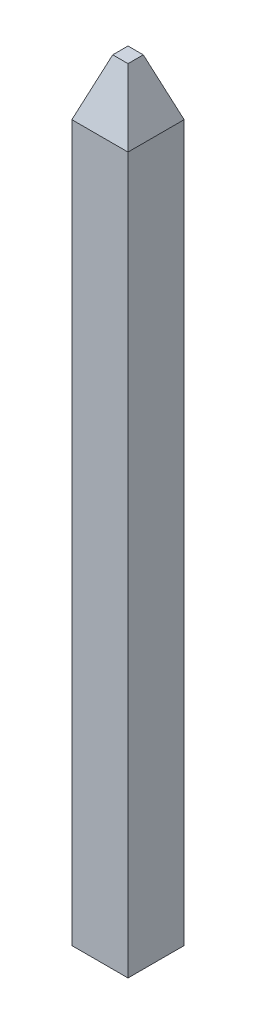
ISO-10303-21;
HEADER;
FILE_DESCRIPTION(('STEP AP214'),'2;1');
FILE_NAME('part.step','',(''),(''),'','','');
FILE_SCHEMA(('AUTOMOTIVE_DESIGN { 1 0 10303 214 1 1 1 1 }'));
ENDSEC;
DATA;
#1=APPLICATION_CONTEXT('core data for automotive mechanical design processes');
#2=APPLICATION_PROTOCOL_DEFINITION('international standard','automotive_design',2000,#1);
#3=PRODUCT_CONTEXT('',#1,'mechanical');
#4=PRODUCT('Part','Part','',(#3));
#5=PRODUCT_RELATED_PRODUCT_CATEGORY('part','',(#4));
#6=PRODUCT_DEFINITION_FORMATION('','',#4);
#7=PRODUCT_DEFINITION_CONTEXT('part definition',#1,'design');
#8=PRODUCT_DEFINITION('design','',#6,#7);
#9=PRODUCT_DEFINITION_SHAPE('','',#8);
#10=(LENGTH_UNIT() NAMED_UNIT(*) SI_UNIT(.MILLI.,.METRE.));
#11=(NAMED_UNIT(*) PLANE_ANGLE_UNIT() SI_UNIT($,.RADIAN.));
#12=(NAMED_UNIT(*) SI_UNIT($,.STERADIAN.) SOLID_ANGLE_UNIT());
#13=UNCERTAINTY_MEASURE_WITH_UNIT(LENGTH_MEASURE(1.E-05),#10,'distance_accuracy_value','');
#14=(GEOMETRIC_REPRESENTATION_CONTEXT(3) GLOBAL_UNCERTAINTY_ASSIGNED_CONTEXT((#13)) GLOBAL_UNIT_ASSIGNED_CONTEXT((#10,
#11,#12)) REPRESENTATION_CONTEXT('',''));
#15=CARTESIAN_POINT('',(0.,0.,0.));
#16=DIRECTION('',(0.,0.,1.));
#17=DIRECTION('',(1.,0.,0.));
#18=AXIS2_PLACEMENT_3D('',#15,#16,#17);
#19=CARTESIAN_POINT('',(-0.25,6.37,0.25));
#20=DIRECTION('',(1.,0.,0.));
#21=DIRECTION('',(0.,0.,-1.));
#22=AXIS2_PLACEMENT_3D('',#19,#20,#21);
#23=PLANE('',#22);
#24=DIRECTION('',(0.,0.,1.));
#25=VECTOR('',#24,1.);
#26=CARTESIAN_POINT('',(-0.25,0.,0.25));
#27=LINE('',#26,#25);
#28=CARTESIAN_POINT('',(-0.25,0.,-0.25));
#29=VERTEX_POINT('',#28);
#30=CARTESIAN_POINT('',(-0.25,0.,0.25));
#31=VERTEX_POINT('',#30);
#32=EDGE_CURVE('E120',#29,#31,#27,.T.);
#33=ORIENTED_EDGE('',*,*,#32,.T.);
#34=DIRECTION('',(0.,-1.,0.));
#35=VECTOR('',#34,1.);
#36=CARTESIAN_POINT('',(-0.25,6.37,0.25));
#37=LINE('',#36,#35);
#38=CARTESIAN_POINT('',(-0.25,6.37,0.25));
#39=VERTEX_POINT('',#38);
#40=EDGE_CURVE('E11',#39,#31,#37,.T.);
#41=ORIENTED_EDGE('',*,*,#40,.F.);
#42=DIRECTION('',(0.,0.,1.));
#43=VECTOR('',#42,1.);
#44=CARTESIAN_POINT('',(-0.25,6.37,0.25));
#45=LINE('',#44,#43);
#46=CARTESIAN_POINT('',(-0.25,6.37,-0.25));
#47=VERTEX_POINT('',#46);
#48=EDGE_CURVE('E92',#47,#39,#45,.T.);
#49=ORIENTED_EDGE('',*,*,#48,.F.);
#50=DIRECTION('',(0.,-1.,0.));
#51=VECTOR('',#50,1.);
#52=CARTESIAN_POINT('',(-0.25,6.37,-0.25));
#53=LINE('',#52,#51);
#54=EDGE_CURVE('E94',#47,#29,#53,.T.);
#55=ORIENTED_EDGE('',*,*,#54,.T.);
#56=EDGE_LOOP('',(#33,#41,#49,#55));
#57=FACE_BOUND('',#56,.T.);
#58=ADVANCED_FACE('F32',(#57),#23,.F.);
#59=CARTESIAN_POINT('',(-0.25,6.37,0.25));
#60=DIRECTION('',(0.,0.,-1.));
#61=DIRECTION('',(-1.,0.,0.));
#62=AXIS2_PLACEMENT_3D('',#59,#60,#61);
#63=PLANE('',#62);
#64=DIRECTION('',(1.,0.,0.));
#65=VECTOR('',#64,1.);
#66=CARTESIAN_POINT('',(-0.25,0.,0.25));
#67=LINE('',#66,#65);
#68=CARTESIAN_POINT('',(0.25,0.,0.25));
#69=VERTEX_POINT('',#68);
#70=EDGE_CURVE('E137',#31,#69,#67,.T.);
#71=ORIENTED_EDGE('',*,*,#70,.T.);
#72=DIRECTION('',(0.,-1.,0.));
#73=VECTOR('',#72,1.);
#74=CARTESIAN_POINT('',(0.25,6.37,0.25));
#75=LINE('',#74,#73);
#76=CARTESIAN_POINT('',(0.25,6.37,0.25));
#77=VERTEX_POINT('',#76);
#78=EDGE_CURVE('E40',#77,#69,#75,.T.);
#79=ORIENTED_EDGE('',*,*,#78,.F.);
#80=DIRECTION('',(1.,0.,0.));
#81=VECTOR('',#80,1.);
#82=CARTESIAN_POINT('',(-0.25,6.37,0.25));
#83=LINE('',#82,#81);
#84=EDGE_CURVE('E74',#39,#77,#83,.T.);
#85=ORIENTED_EDGE('',*,*,#84,.F.);
#86=ORIENTED_EDGE('',*,*,#40,.T.);
#87=EDGE_LOOP('',(#71,#79,#85,#86));
#88=FACE_BOUND('',#87,.T.);
#89=ADVANCED_FACE('F144',(#88),#63,.F.);
#90=CARTESIAN_POINT('',(0.25,6.37,0.25));
#91=DIRECTION('',(-1.,0.,0.));
#92=DIRECTION('',(0.,0.,1.));
#93=AXIS2_PLACEMENT_3D('',#90,#91,#92);
#94=PLANE('',#93);
#95=DIRECTION('',(0.,0.,-1.));
#96=VECTOR('',#95,1.);
#97=CARTESIAN_POINT('',(0.25,0.,0.25));
#98=LINE('',#97,#96);
#99=CARTESIAN_POINT('',(0.25,0.,-0.25));
#100=VERTEX_POINT('',#99);
#101=EDGE_CURVE('E64',#69,#100,#98,.T.);
#102=ORIENTED_EDGE('',*,*,#101,.T.);
#103=DIRECTION('',(0.,-1.,0.));
#104=VECTOR('',#103,1.);
#105=CARTESIAN_POINT('',(0.25,6.37,-0.25));
#106=LINE('',#105,#104);
#107=CARTESIAN_POINT('',(0.25,6.37,-0.25));
#108=VERTEX_POINT('',#107);
#109=EDGE_CURVE('E48',#108,#100,#106,.T.);
#110=ORIENTED_EDGE('',*,*,#109,.F.);
#111=DIRECTION('',(0.,0.,-1.));
#112=VECTOR('',#111,1.);
#113=CARTESIAN_POINT('',(0.25,6.37,0.25));
#114=LINE('',#113,#112);
#115=EDGE_CURVE('E114',#77,#108,#114,.T.);
#116=ORIENTED_EDGE('',*,*,#115,.F.);
#117=ORIENTED_EDGE('',*,*,#78,.T.);
#118=EDGE_LOOP('',(#102,#110,#116,#117));
#119=FACE_BOUND('',#118,.T.);
#120=ADVANCED_FACE('F141',(#119),#94,.F.);
#121=CARTESIAN_POINT('',(-0.25,6.37,-0.25));
#122=DIRECTION('',(0.,0.,1.));
#123=DIRECTION('',(1.,0.,0.));
#124=AXIS2_PLACEMENT_3D('',#121,#122,#123);
#125=PLANE('',#124);
#126=DIRECTION('',(-1.,0.,0.));
#127=VECTOR('',#126,1.);
#128=CARTESIAN_POINT('',(-0.25,0.,-0.25));
#129=LINE('',#128,#127);
#130=EDGE_CURVE('E69',#100,#29,#129,.T.);
#131=ORIENTED_EDGE('',*,*,#130,.T.);
#132=ORIENTED_EDGE('',*,*,#54,.F.);
#133=DIRECTION('',(-1.,0.,0.));
#134=VECTOR('',#133,1.);
#135=CARTESIAN_POINT('',(-0.25,6.37,-0.25));
#136=LINE('',#135,#134);
#137=EDGE_CURVE('E103',#108,#47,#136,.T.);
#138=ORIENTED_EDGE('',*,*,#137,.F.);
#139=ORIENTED_EDGE('',*,*,#109,.T.);
#140=EDGE_LOOP('',(#131,#132,#138,#139));
#141=FACE_BOUND('',#140,.T.);
#142=ADVANCED_FACE('F102',(#141),#125,.F.);
#143=CARTESIAN_POINT('',(-0.25,0.,-0.25));
#144=DIRECTION('',(0.,-1.,0.));
#145=DIRECTION('',(0.,0.,-1.));
#146=AXIS2_PLACEMENT_3D('',#143,#144,#145);
#147=PLANE('',#146);
#148=ORIENTED_EDGE('',*,*,#32,.F.);
#149=ORIENTED_EDGE('',*,*,#130,.F.);
#150=ORIENTED_EDGE('',*,*,#101,.F.);
#151=ORIENTED_EDGE('',*,*,#70,.F.);
#152=EDGE_LOOP('',(#148,#149,#150,#151));
#153=FACE_BOUND('',#152,.T.);
#154=ADVANCED_FACE('F143',(#153),#147,.T.);
#155=CARTESIAN_POINT('',(0.25,6.37,0.25));
#156=DIRECTION('',(0.939692620785908,0.342020143325669,0.));
#157=DIRECTION('',(-0.342020143325669,0.939692620785908,0.));
#158=AXIS2_PLACEMENT_3D('',#155,#156,#157);
#159=PLANE('',#158);
#160=ORIENTED_EDGE('',*,*,#115,.T.);
#161=DIRECTION('',(0.323615577118185,-0.889126490715988,-0.323615577118185));
#162=VECTOR('',#161,1.);
#163=CARTESIAN_POINT('',(0.25,6.37,-0.25));
#164=LINE('',#163,#162);
#165=CARTESIAN_POINT('',(0.0680148828668988,6.87,-0.0680148828668988));
#166=VERTEX_POINT('',#165);
#167=EDGE_CURVE('E112',#166,#108,#164,.T.);
#168=ORIENTED_EDGE('',*,*,#167,.F.);
#169=DIRECTION('',(0.,0.,1.));
#170=VECTOR('',#169,1.);
#171=CARTESIAN_POINT('',(0.0680148828668988,6.87,0.25));
#172=LINE('',#171,#170);
#173=CARTESIAN_POINT('',(0.0680148828668988,6.87,0.0680148828668988));
#174=VERTEX_POINT('',#173);
#175=EDGE_CURVE('E126',#174,#166,#172,.F.);
#176=ORIENTED_EDGE('',*,*,#175,.F.);
#177=DIRECTION('',(0.323615577118185,-0.889126490715988,0.323615577118185));
#178=VECTOR('',#177,1.);
#179=CARTESIAN_POINT('',(0.25,6.37,0.25));
#180=LINE('',#179,#178);
#181=EDGE_CURVE('E122',#174,#77,#180,.T.);
#182=ORIENTED_EDGE('',*,*,#181,.T.);
#183=EDGE_LOOP('',(#160,#168,#176,#182));
#184=FACE_BOUND('',#183,.T.);
#185=ADVANCED_FACE('F156',(#184),#159,.T.);
#186=CARTESIAN_POINT('',(0.25,6.37,-0.25));
#187=DIRECTION('',(0.,0.342020143325669,-0.939692620785908));
#188=DIRECTION('',(0.,0.939692620785908,0.342020143325669));
#189=AXIS2_PLACEMENT_3D('',#186,#187,#188);
#190=PLANE('',#189);
#191=ORIENTED_EDGE('',*,*,#137,.T.);
#192=DIRECTION('',(-0.323615577118185,-0.889126490715988,-0.323615577118185));
#193=VECTOR('',#192,1.);
#194=CARTESIAN_POINT('',(-0.197636479123232,6.51386759121206,-0.197636479123232));
#195=LINE('',#194,#193);
#196=CARTESIAN_POINT('',(-0.0680148828668988,6.87,-0.0680148828668988));
#197=VERTEX_POINT('',#196);
#198=EDGE_CURVE('E109',#197,#47,#195,.T.);
#199=ORIENTED_EDGE('',*,*,#198,.F.);
#200=DIRECTION('',(1.,0.,0.));
#201=VECTOR('',#200,1.);
#202=CARTESIAN_POINT('',(0.25,6.87,-0.0680148828668988));
#203=LINE('',#202,#201);
#204=EDGE_CURVE('E129',#166,#197,#203,.F.);
#205=ORIENTED_EDGE('',*,*,#204,.F.);
#206=ORIENTED_EDGE('',*,*,#167,.T.);
#207=EDGE_LOOP('',(#191,#199,#205,#206));
#208=FACE_BOUND('',#207,.T.);
#209=ADVANCED_FACE('F108',(#208),#190,.T.);
#210=CARTESIAN_POINT('',(-0.25,6.37,0.25));
#211=DIRECTION('',(-0.939692620785908,0.342020143325669,0.));
#212=DIRECTION('',(-0.342020143325669,-0.939692620785908,0.));
#213=AXIS2_PLACEMENT_3D('',#210,#211,#212);
#214=PLANE('',#213);
#215=ORIENTED_EDGE('',*,*,#48,.T.);
#216=DIRECTION('',(-0.323615577118185,-0.889126490715988,0.323615577118185));
#217=VECTOR('',#216,1.);
#218=CARTESIAN_POINT('',(-0.197636479123232,6.51386759121206,0.197636479123232));
#219=LINE('',#218,#217);
#220=CARTESIAN_POINT('',(-0.0680148828668988,6.87,0.0680148828668988));
#221=VERTEX_POINT('',#220);
#222=EDGE_CURVE('E118',#221,#39,#219,.T.);
#223=ORIENTED_EDGE('',*,*,#222,.F.);
#224=DIRECTION('',(0.,0.,-1.));
#225=VECTOR('',#224,1.);
#226=CARTESIAN_POINT('',(-0.0680148828668988,6.87,0.25));
#227=LINE('',#226,#225);
#228=EDGE_CURVE('E117',#197,#221,#227,.F.);
#229=ORIENTED_EDGE('',*,*,#228,.F.);
#230=ORIENTED_EDGE('',*,*,#198,.T.);
#231=EDGE_LOOP('',(#215,#223,#229,#230));
#232=FACE_BOUND('',#231,.T.);
#233=ADVANCED_FACE('F116',(#232),#214,.T.);
#234=CARTESIAN_POINT('',(0.25,6.37,0.25));
#235=DIRECTION('',(0.,0.342020143325669,0.939692620785908));
#236=DIRECTION('',(0.,-0.939692620785908,0.342020143325669));
#237=AXIS2_PLACEMENT_3D('',#234,#235,#236);
#238=PLANE('',#237);
#239=ORIENTED_EDGE('',*,*,#84,.T.);
#240=ORIENTED_EDGE('',*,*,#181,.F.);
#241=DIRECTION('',(-1.,0.,0.));
#242=VECTOR('',#241,1.);
#243=CARTESIAN_POINT('',(0.25,6.87,0.0680148828668988));
#244=LINE('',#243,#242);
#245=EDGE_CURVE('E132',#221,#174,#244,.F.);
#246=ORIENTED_EDGE('',*,*,#245,.F.);
#247=ORIENTED_EDGE('',*,*,#222,.T.);
#248=EDGE_LOOP('',(#239,#240,#246,#247));
#249=FACE_BOUND('',#248,.T.);
#250=ADVANCED_FACE('F161',(#249),#238,.T.);
#251=CARTESIAN_POINT('',(0.25,6.87,-0.25));
#252=DIRECTION('',(0.,1.,0.));
#253=DIRECTION('',(0.,0.,1.));
#254=AXIS2_PLACEMENT_3D('',#251,#252,#253);
#255=PLANE('',#254);
#256=ORIENTED_EDGE('',*,*,#175,.T.);
#257=ORIENTED_EDGE('',*,*,#204,.T.);
#258=ORIENTED_EDGE('',*,*,#228,.T.);
#259=ORIENTED_EDGE('',*,*,#245,.T.);
#260=EDGE_LOOP('',(#256,#257,#258,#259));
#261=FACE_BOUND('',#260,.T.);
#262=ADVANCED_FACE('F164',(#261),#255,.T.);
#263=CLOSED_SHELL('',(#58,#89,#120,#142,#154,#185,#209,#233,#250,#262));
#264=MANIFOLD_SOLID_BREP('B2',#263);
#265=ADVANCED_BREP_SHAPE_REPRESENTATION('',(#18,#264),#14);
#266=SHAPE_DEFINITION_REPRESENTATION(#9,#265);
ENDSEC;
END-ISO-10303-21;
